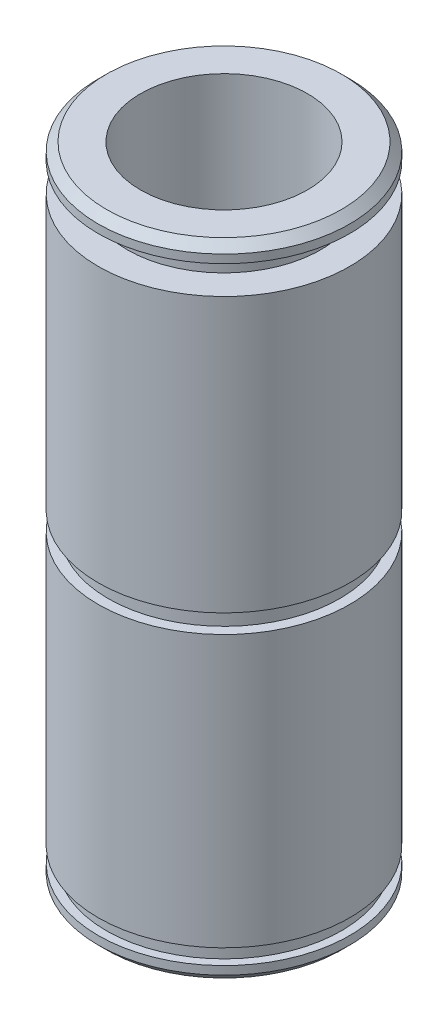
ISO-10303-21;
HEADER;
FILE_DESCRIPTION(('STEP AP214'),'2;1');
FILE_NAME('part.step','',(''),(''),'','','');
FILE_SCHEMA(('AUTOMOTIVE_DESIGN { 1 0 10303 214 1 1 1 1 }'));
ENDSEC;
DATA;
#1=APPLICATION_CONTEXT('core data for automotive mechanical design processes');
#2=APPLICATION_PROTOCOL_DEFINITION('international standard','automotive_design',2000,#1);
#3=PRODUCT_CONTEXT('',#1,'mechanical');
#4=PRODUCT('Part','Part','',(#3));
#5=PRODUCT_RELATED_PRODUCT_CATEGORY('part','',(#4));
#6=PRODUCT_DEFINITION_FORMATION('','',#4);
#7=PRODUCT_DEFINITION_CONTEXT('part definition',#1,'design');
#8=PRODUCT_DEFINITION('design','',#6,#7);
#9=PRODUCT_DEFINITION_SHAPE('','',#8);
#10=(LENGTH_UNIT() NAMED_UNIT(*) SI_UNIT(.MILLI.,.METRE.));
#11=(NAMED_UNIT(*) PLANE_ANGLE_UNIT() SI_UNIT($,.RADIAN.));
#12=(NAMED_UNIT(*) SI_UNIT($,.STERADIAN.) SOLID_ANGLE_UNIT());
#13=UNCERTAINTY_MEASURE_WITH_UNIT(LENGTH_MEASURE(1.E-05),#10,'distance_accuracy_value','');
#14=(GEOMETRIC_REPRESENTATION_CONTEXT(3) GLOBAL_UNCERTAINTY_ASSIGNED_CONTEXT((#13)) GLOBAL_UNIT_ASSIGNED_CONTEXT((#10,
#11,#12)) REPRESENTATION_CONTEXT('',''));
#15=CARTESIAN_POINT('',(0.,0.,0.));
#16=DIRECTION('',(0.,0.,1.));
#17=DIRECTION('',(1.,0.,0.));
#18=AXIS2_PLACEMENT_3D('',#15,#16,#17);
#19=CARTESIAN_POINT('',(0.,55.,0.));
#20=DIRECTION('',(0.,1.,0.));
#21=DIRECTION('',(0.,0.,1.));
#22=AXIS2_PLACEMENT_3D('',#19,#20,#21);
#23=CYLINDRICAL_SURFACE('',#22,6.35);
#24=CARTESIAN_POINT('',(0.,48.76292,0.));
#25=DIRECTION('',(0.,1.,0.));
#26=DIRECTION('',(0.,0.,1.));
#27=AXIS2_PLACEMENT_3D('',#24,#25,#26);
#28=CIRCLE('',#27,6.35);
#29=CARTESIAN_POINT('',(0.,48.76292,6.35));
#30=VERTEX_POINT('',#29);
#31=EDGE_CURVE('E54',#30,#30,#28,.T.);
#32=ORIENTED_EDGE('',*,*,#31,.T.);
#33=EDGE_LOOP('',(#32));
#34=FACE_BOUND('',#33,.T.);
#35=CARTESIAN_POINT('',(0.,0.,0.));
#36=DIRECTION('',(0.,1.,0.));
#37=DIRECTION('',(0.,0.,1.));
#38=AXIS2_PLACEMENT_3D('',#35,#36,#37);
#39=CIRCLE('',#38,6.35);
#40=CARTESIAN_POINT('',(0.,0.,6.35));
#41=VERTEX_POINT('',#40);
#42=EDGE_CURVE('E93',#41,#41,#39,.T.);
#43=ORIENTED_EDGE('',*,*,#42,.F.);
#44=EDGE_LOOP('',(#43));
#45=FACE_BOUND('',#44,.T.);
#46=ADVANCED_FACE('F34',(#34,#45),#23,.F.);
#47=CARTESIAN_POINT('',(-6.35,48.76292,0.));
#48=DIRECTION('',(0.,1.,0.));
#49=DIRECTION('',(0.,0.,1.));
#50=AXIS2_PLACEMENT_3D('',#47,#48,#49);
#51=PLANE('',#50);
#52=CARTESIAN_POINT('',(0.,48.76292,0.));
#53=DIRECTION('',(0.,1.,0.));
#54=DIRECTION('',(0.,0.,1.));
#55=AXIS2_PLACEMENT_3D('',#52,#53,#54);
#56=CIRCLE('',#55,8.9281);
#57=CARTESIAN_POINT('',(0.,48.76292,8.9281));
#58=VERTEX_POINT('',#57);
#59=EDGE_CURVE('E49',#58,#58,#56,.T.);
#60=ORIENTED_EDGE('',*,*,#59,.T.);
#61=EDGE_LOOP('',(#60));
#62=FACE_BOUND('',#61,.T.);
#63=ORIENTED_EDGE('',*,*,#31,.F.);
#64=EDGE_LOOP('',(#63));
#65=FACE_BOUND('',#64,.T.);
#66=ADVANCED_FACE('F100',(#62,#65),#51,.T.);
#67=CARTESIAN_POINT('',(0.,55.,0.));
#68=DIRECTION('',(0.,1.,0.));
#69=DIRECTION('',(0.,0.,1.));
#70=AXIS2_PLACEMENT_3D('',#67,#68,#69);
#71=CYLINDRICAL_SURFACE('',#70,9.5631);
#72=CARTESIAN_POINT('',(0.,48.12792,0.));
#73=DIRECTION('',(0.,1.,0.));
#74=DIRECTION('',(0.,0.,1.));
#75=AXIS2_PLACEMENT_3D('',#72,#73,#74);
#76=CIRCLE('',#75,9.5631);
#77=CARTESIAN_POINT('',(0.,48.12792,9.5631));
#78=VERTEX_POINT('',#77);
#79=EDGE_CURVE('E45',#78,#78,#76,.F.);
#80=ORIENTED_EDGE('',*,*,#79,.T.);
#81=EDGE_LOOP('',(#80));
#82=FACE_BOUND('',#81,.T.);
#83=CARTESIAN_POINT('',(0.,47.49292,0.));
#84=DIRECTION('',(0.,1.,0.));
#85=DIRECTION('',(0.,0.,1.));
#86=AXIS2_PLACEMENT_3D('',#83,#84,#85);
#87=CIRCLE('',#86,9.5631);
#88=CARTESIAN_POINT('',(0.,47.49292,9.5631));
#89=VERTEX_POINT('',#88);
#90=EDGE_CURVE('E57',#89,#89,#87,.T.);
#91=ORIENTED_EDGE('',*,*,#90,.T.);
#92=EDGE_LOOP('',(#91));
#93=FACE_BOUND('',#92,.T.);
#94=ADVANCED_FACE('F106',(#82,#93),#71,.T.);
#95=CARTESIAN_POINT('',(-9.5631,47.49292,0.));
#96=DIRECTION('',(0.,-1.,0.));
#97=DIRECTION('',(0.,0.,-1.));
#98=AXIS2_PLACEMENT_3D('',#95,#96,#97);
#99=PLANE('',#98);
#100=CARTESIAN_POINT('',(0.,47.49292,0.));
#101=DIRECTION('',(0.,1.,0.));
#102=DIRECTION('',(0.,0.,1.));
#103=AXIS2_PLACEMENT_3D('',#100,#101,#102);
#104=CIRCLE('',#103,7.366);
#105=CARTESIAN_POINT('',(0.,47.49292,7.366));
#106=VERTEX_POINT('',#105);
#107=EDGE_CURVE('E60',#106,#106,#104,.T.);
#108=ORIENTED_EDGE('',*,*,#107,.T.);
#109=EDGE_LOOP('',(#108));
#110=FACE_BOUND('',#109,.T.);
#111=ORIENTED_EDGE('',*,*,#90,.F.);
#112=EDGE_LOOP('',(#111));
#113=FACE_BOUND('',#112,.T.);
#114=ADVANCED_FACE('F128',(#110,#113),#99,.T.);
#115=CARTESIAN_POINT('',(0.,55.,0.));
#116=DIRECTION('',(0.,1.,0.));
#117=DIRECTION('',(0.,0.,1.));
#118=AXIS2_PLACEMENT_3D('',#115,#116,#117);
#119=CYLINDRICAL_SURFACE('',#118,7.366);
#120=CARTESIAN_POINT('',(0.,45.33392,0.));
#121=DIRECTION('',(0.,1.,0.));
#122=DIRECTION('',(0.,0.,1.));
#123=AXIS2_PLACEMENT_3D('',#120,#121,#122);
#124=CIRCLE('',#123,7.366);
#125=CARTESIAN_POINT('',(0.,45.33392,7.366));
#126=VERTEX_POINT('',#125);
#127=EDGE_CURVE('E63',#126,#126,#124,.T.);
#128=ORIENTED_EDGE('',*,*,#127,.T.);
#129=EDGE_LOOP('',(#128));
#130=FACE_BOUND('',#129,.T.);
#131=ORIENTED_EDGE('',*,*,#107,.F.);
#132=EDGE_LOOP('',(#131));
#133=FACE_BOUND('',#132,.T.);
#134=ADVANCED_FACE('F132',(#130,#133),#119,.T.);
#135=CARTESIAN_POINT('',(-9.5631,45.33392,0.));
#136=DIRECTION('',(0.,1.,0.));
#137=DIRECTION('',(0.,0.,1.));
#138=AXIS2_PLACEMENT_3D('',#135,#136,#137);
#139=PLANE('',#138);
#140=CARTESIAN_POINT('',(0.,45.33392,0.));
#141=DIRECTION('',(0.,1.,0.));
#142=DIRECTION('',(0.,0.,1.));
#143=AXIS2_PLACEMENT_3D('',#140,#141,#142);
#144=CIRCLE('',#143,9.5631);
#145=CARTESIAN_POINT('',(0.,45.33392,9.5631));
#146=VERTEX_POINT('',#145);
#147=EDGE_CURVE('E66',#146,#146,#144,.T.);
#148=ORIENTED_EDGE('',*,*,#147,.T.);
#149=EDGE_LOOP('',(#148));
#150=FACE_BOUND('',#149,.T.);
#151=ORIENTED_EDGE('',*,*,#127,.F.);
#152=EDGE_LOOP('',(#151));
#153=FACE_BOUND('',#152,.T.);
#154=ADVANCED_FACE('F138',(#150,#153),#139,.T.);
#155=CARTESIAN_POINT('',(0.,55.,0.));
#156=DIRECTION('',(0.,1.,0.));
#157=DIRECTION('',(0.,0.,1.));
#158=AXIS2_PLACEMENT_3D('',#155,#156,#157);
#159=CYLINDRICAL_SURFACE('',#158,9.5631);
#160=CARTESIAN_POINT('',(0.,24.49576,0.));
#161=DIRECTION('',(0.,1.,0.));
#162=DIRECTION('',(0.,0.,1.));
#163=AXIS2_PLACEMENT_3D('',#160,#161,#162);
#164=CIRCLE('',#163,9.5631);
#165=CARTESIAN_POINT('',(0.,24.49576,9.5631));
#166=VERTEX_POINT('',#165);
#167=EDGE_CURVE('E69',#166,#166,#164,.T.);
#168=ORIENTED_EDGE('',*,*,#167,.T.);
#169=EDGE_LOOP('',(#168));
#170=FACE_BOUND('',#169,.T.);
#171=ORIENTED_EDGE('',*,*,#147,.F.);
#172=EDGE_LOOP('',(#171));
#173=FACE_BOUND('',#172,.T.);
#174=ADVANCED_FACE('F144',(#170,#173),#159,.T.);
#175=CARTESIAN_POINT('',(-9.5631,24.49576,0.));
#176=DIRECTION('',(0.,-1.,0.));
#177=DIRECTION('',(0.,0.,-1.));
#178=AXIS2_PLACEMENT_3D('',#175,#176,#177);
#179=PLANE('',#178);
#180=CARTESIAN_POINT('',(0.,24.49576,0.));
#181=DIRECTION('',(0.,1.,0.));
#182=DIRECTION('',(0.,0.,1.));
#183=AXIS2_PLACEMENT_3D('',#180,#181,#182);
#184=CIRCLE('',#183,8.80109999999999);
#185=CARTESIAN_POINT('',(0.,24.49576,8.80109999999999));
#186=VERTEX_POINT('',#185);
#187=EDGE_CURVE('E72',#186,#186,#184,.T.);
#188=ORIENTED_EDGE('',*,*,#187,.T.);
#189=EDGE_LOOP('',(#188));
#190=FACE_BOUND('',#189,.T.);
#191=ORIENTED_EDGE('',*,*,#167,.F.);
#192=EDGE_LOOP('',(#191));
#193=FACE_BOUND('',#192,.T.);
#194=ADVANCED_FACE('F148',(#190,#193),#179,.T.);
#195=CARTESIAN_POINT('',(0.,55.,0.));
#196=DIRECTION('',(0.,1.,0.));
#197=DIRECTION('',(0.,0.,1.));
#198=AXIS2_PLACEMENT_3D('',#195,#196,#197);
#199=CYLINDRICAL_SURFACE('',#198,8.80109999999999);
#200=CARTESIAN_POINT('',(0.,23.07336,0.));
#201=DIRECTION('',(0.,1.,0.));
#202=DIRECTION('',(0.,0.,1.));
#203=AXIS2_PLACEMENT_3D('',#200,#201,#202);
#204=CIRCLE('',#203,8.80109999999999);
#205=CARTESIAN_POINT('',(0.,23.07336,8.80109999999999));
#206=VERTEX_POINT('',#205);
#207=EDGE_CURVE('E75',#206,#206,#204,.T.);
#208=ORIENTED_EDGE('',*,*,#207,.T.);
#209=EDGE_LOOP('',(#208));
#210=FACE_BOUND('',#209,.T.);
#211=ORIENTED_EDGE('',*,*,#187,.F.);
#212=EDGE_LOOP('',(#211));
#213=FACE_BOUND('',#212,.T.);
#214=ADVANCED_FACE('F152',(#210,#213),#199,.T.);
#215=CARTESIAN_POINT('',(-9.5631,23.07336,0.));
#216=DIRECTION('',(0.,1.,0.));
#217=DIRECTION('',(0.,0.,1.));
#218=AXIS2_PLACEMENT_3D('',#215,#216,#217);
#219=PLANE('',#218);
#220=CARTESIAN_POINT('',(0.,23.07336,0.));
#221=DIRECTION('',(0.,1.,0.));
#222=DIRECTION('',(0.,0.,1.));
#223=AXIS2_PLACEMENT_3D('',#220,#221,#222);
#224=CIRCLE('',#223,9.5631);
#225=CARTESIAN_POINT('',(0.,23.07336,9.5631));
#226=VERTEX_POINT('',#225);
#227=EDGE_CURVE('E78',#226,#226,#224,.T.);
#228=ORIENTED_EDGE('',*,*,#227,.T.);
#229=EDGE_LOOP('',(#228));
#230=FACE_BOUND('',#229,.T.);
#231=ORIENTED_EDGE('',*,*,#207,.F.);
#232=EDGE_LOOP('',(#231));
#233=FACE_BOUND('',#232,.T.);
#234=ADVANCED_FACE('F156',(#230,#233),#219,.T.);
#235=CARTESIAN_POINT('',(0.,55.,0.));
#236=DIRECTION('',(0.,1.,0.));
#237=DIRECTION('',(0.,0.,1.));
#238=AXIS2_PLACEMENT_3D('',#235,#236,#237);
#239=CYLINDRICAL_SURFACE('',#238,9.5631);
#240=CARTESIAN_POINT('',(0.,2.4384,0.));
#241=DIRECTION('',(0.,1.,0.));
#242=DIRECTION('',(0.,0.,1.));
#243=AXIS2_PLACEMENT_3D('',#240,#241,#242);
#244=CIRCLE('',#243,9.5631);
#245=CARTESIAN_POINT('',(0.,2.4384,9.5631));
#246=VERTEX_POINT('',#245);
#247=EDGE_CURVE('E81',#246,#246,#244,.T.);
#248=ORIENTED_EDGE('',*,*,#247,.T.);
#249=EDGE_LOOP('',(#248));
#250=FACE_BOUND('',#249,.T.);
#251=ORIENTED_EDGE('',*,*,#227,.F.);
#252=EDGE_LOOP('',(#251));
#253=FACE_BOUND('',#252,.T.);
#254=ADVANCED_FACE('F160',(#250,#253),#239,.T.);
#255=CARTESIAN_POINT('',(-9.5631,2.4384,0.));
#256=DIRECTION('',(0.,-1.,0.));
#257=DIRECTION('',(0.,0.,-1.));
#258=AXIS2_PLACEMENT_3D('',#255,#256,#257);
#259=PLANE('',#258);
#260=CARTESIAN_POINT('',(0.,2.4384,0.));
#261=DIRECTION('',(0.,1.,0.));
#262=DIRECTION('',(0.,0.,1.));
#263=AXIS2_PLACEMENT_3D('',#260,#261,#262);
#264=CIRCLE('',#263,8.9408);
#265=CARTESIAN_POINT('',(0.,2.4384,8.9408));
#266=VERTEX_POINT('',#265);
#267=EDGE_CURVE('E84',#266,#266,#264,.T.);
#268=ORIENTED_EDGE('',*,*,#267,.T.);
#269=EDGE_LOOP('',(#268));
#270=FACE_BOUND('',#269,.T.);
#271=ORIENTED_EDGE('',*,*,#247,.F.);
#272=EDGE_LOOP('',(#271));
#273=FACE_BOUND('',#272,.T.);
#274=ADVANCED_FACE('F164',(#270,#273),#259,.T.);
#275=CARTESIAN_POINT('',(0.,55.,0.));
#276=DIRECTION('',(0.,1.,0.));
#277=DIRECTION('',(0.,0.,1.));
#278=AXIS2_PLACEMENT_3D('',#275,#276,#277);
#279=CYLINDRICAL_SURFACE('',#278,8.9408);
#280=CARTESIAN_POINT('',(0.,1.27,0.));
#281=DIRECTION('',(0.,1.,0.));
#282=DIRECTION('',(0.,0.,1.));
#283=AXIS2_PLACEMENT_3D('',#280,#281,#282);
#284=CIRCLE('',#283,8.9408);
#285=CARTESIAN_POINT('',(0.,1.27,8.9408));
#286=VERTEX_POINT('',#285);
#287=EDGE_CURVE('E87',#286,#286,#284,.T.);
#288=ORIENTED_EDGE('',*,*,#287,.T.);
#289=EDGE_LOOP('',(#288));
#290=FACE_BOUND('',#289,.T.);
#291=ORIENTED_EDGE('',*,*,#267,.F.);
#292=EDGE_LOOP('',(#291));
#293=FACE_BOUND('',#292,.T.);
#294=ADVANCED_FACE('F168',(#290,#293),#279,.T.);
#295=CARTESIAN_POINT('',(-9.5631,1.27,0.));
#296=DIRECTION('',(0.,1.,0.));
#297=DIRECTION('',(0.,0.,1.));
#298=AXIS2_PLACEMENT_3D('',#295,#296,#297);
#299=PLANE('',#298);
#300=CARTESIAN_POINT('',(0.,1.27,0.));
#301=DIRECTION('',(0.,1.,0.));
#302=DIRECTION('',(0.,0.,1.));
#303=AXIS2_PLACEMENT_3D('',#300,#301,#302);
#304=CIRCLE('',#303,9.5631);
#305=CARTESIAN_POINT('',(0.,1.27,9.5631));
#306=VERTEX_POINT('',#305);
#307=EDGE_CURVE('E90',#306,#306,#304,.T.);
#308=ORIENTED_EDGE('',*,*,#307,.T.);
#309=EDGE_LOOP('',(#308));
#310=FACE_BOUND('',#309,.T.);
#311=ORIENTED_EDGE('',*,*,#287,.F.);
#312=EDGE_LOOP('',(#311));
#313=FACE_BOUND('',#312,.T.);
#314=ADVANCED_FACE('F172',(#310,#313),#299,.T.);
#315=CARTESIAN_POINT('',(0.,55.,0.));
#316=DIRECTION('',(0.,1.,0.));
#317=DIRECTION('',(0.,0.,1.));
#318=AXIS2_PLACEMENT_3D('',#315,#316,#317);
#319=CYLINDRICAL_SURFACE('',#318,9.5631);
#320=CARTESIAN_POINT('',(0.,0.63499999999999,0.));
#321=DIRECTION('',(0.,-1.,0.));
#322=DIRECTION('',(0.,0.,-1.));
#323=AXIS2_PLACEMENT_3D('',#320,#321,#322);
#324=CIRCLE('',#323,9.5631);
#325=CARTESIAN_POINT('',(0.,0.63499999999999,-9.5631));
#326=VERTEX_POINT('',#325);
#327=EDGE_CURVE('E41',#326,#326,#324,.F.);
#328=ORIENTED_EDGE('',*,*,#327,.T.);
#329=EDGE_LOOP('',(#328));
#330=FACE_BOUND('',#329,.T.);
#331=ORIENTED_EDGE('',*,*,#307,.F.);
#332=EDGE_LOOP('',(#331));
#333=FACE_BOUND('',#332,.T.);
#334=ADVANCED_FACE('F118',(#330,#333),#319,.T.);
#335=CARTESIAN_POINT('',(-6.35,0.,0.));
#336=DIRECTION('',(0.,-1.,0.));
#337=DIRECTION('',(0.,0.,-1.));
#338=AXIS2_PLACEMENT_3D('',#335,#336,#337);
#339=PLANE('',#338);
#340=CARTESIAN_POINT('',(0.,0.,0.));
#341=DIRECTION('',(0.,-1.,0.));
#342=DIRECTION('',(0.,0.,-1.));
#343=AXIS2_PLACEMENT_3D('',#340,#341,#342);
#344=CIRCLE('',#343,8.9281);
#345=CARTESIAN_POINT('',(0.,0.,-8.9281));
#346=VERTEX_POINT('',#345);
#347=EDGE_CURVE('E10',#346,#346,#344,.T.);
#348=ORIENTED_EDGE('',*,*,#347,.T.);
#349=EDGE_LOOP('',(#348));
#350=FACE_BOUND('',#349,.T.);
#351=ORIENTED_EDGE('',*,*,#42,.T.);
#352=EDGE_LOOP('',(#351));
#353=FACE_BOUND('',#352,.T.);
#354=ADVANCED_FACE('F97',(#350,#353),#339,.T.);
#355=CARTESIAN_POINT('',(0.,48.76292,0.));
#356=DIRECTION('',(0.,-1.,0.));
#357=DIRECTION('',(0.,0.,-1.));
#358=AXIS2_PLACEMENT_3D('',#355,#356,#357);
#359=CONICAL_SURFACE('',#358,8.9281,0.785398163397444);
#360=ORIENTED_EDGE('',*,*,#79,.F.);
#361=EDGE_LOOP('',(#360));
#362=FACE_BOUND('',#361,.T.);
#363=ORIENTED_EDGE('',*,*,#59,.F.);
#364=EDGE_LOOP('',(#363));
#365=FACE_BOUND('',#364,.T.);
#366=ADVANCED_FACE('F110',(#362,#365),#359,.T.);
#367=CARTESIAN_POINT('',(0.,0.63499999999999,0.));
#368=DIRECTION('',(0.,1.,0.));
#369=DIRECTION('',(0.,0.,1.));
#370=AXIS2_PLACEMENT_3D('',#367,#368,#369);
#371=CONICAL_SURFACE('',#370,9.5631,0.785398163397458);
#372=ORIENTED_EDGE('',*,*,#347,.F.);
#373=EDGE_LOOP('',(#372));
#374=FACE_BOUND('',#373,.T.);
#375=ORIENTED_EDGE('',*,*,#327,.F.);
#376=EDGE_LOOP('',(#375));
#377=FACE_BOUND('',#376,.T.);
#378=ADVANCED_FACE('F36',(#374,#377),#371,.T.);
#379=CLOSED_SHELL('',(#46,#66,#94,#114,#134,#154,#174,#194,#214,#234,#254,#274,#294,#314,#334,
#354,#366,#378));
#380=MANIFOLD_SOLID_BREP('B2',#379);
#381=ADVANCED_BREP_SHAPE_REPRESENTATION('',(#18,#380),#14);
#382=SHAPE_DEFINITION_REPRESENTATION(#9,#381);
ENDSEC;
END-ISO-10303-21;
